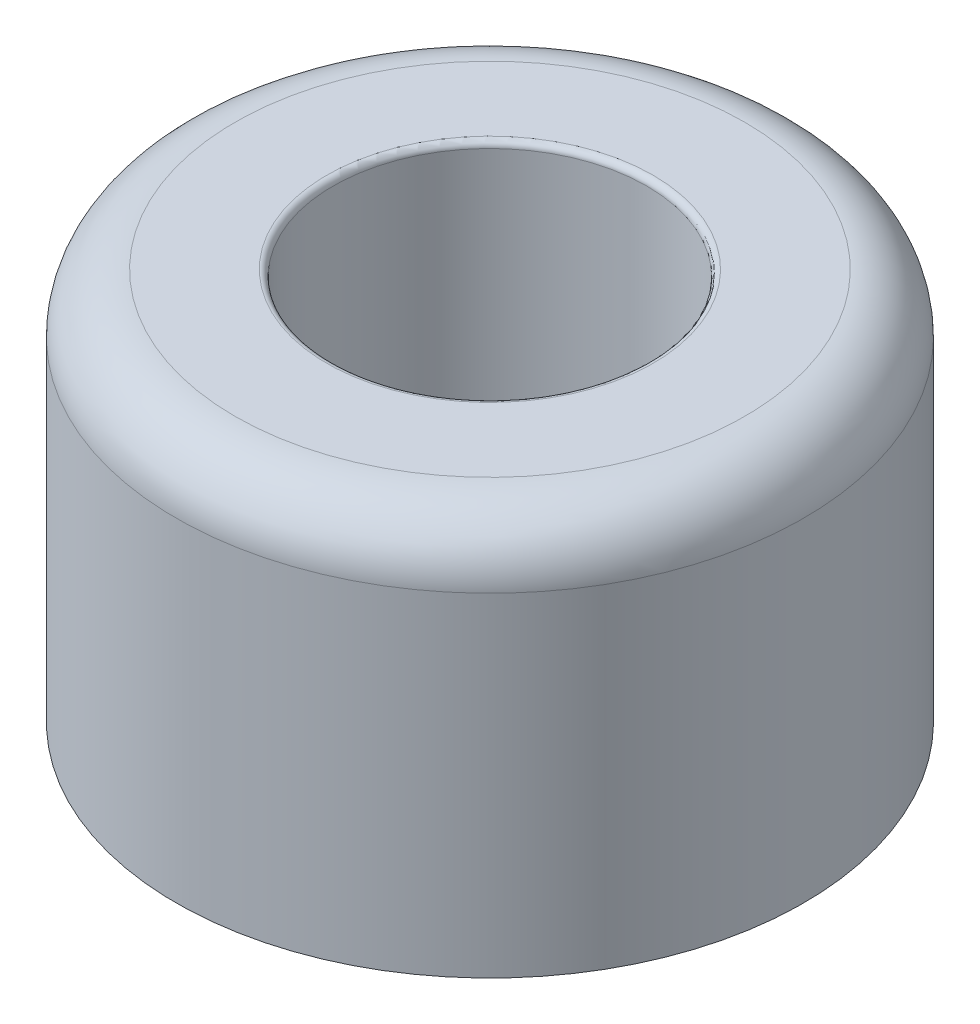
ISO-10303-21;
HEADER;
FILE_DESCRIPTION(('STEP AP214'),'2;1');
FILE_NAME('part.step','',(''),(''),'','','');
FILE_SCHEMA(('AUTOMOTIVE_DESIGN { 1 0 10303 214 1 1 1 1 }'));
ENDSEC;
DATA;
#1=APPLICATION_CONTEXT('core data for automotive mechanical design processes');
#2=APPLICATION_PROTOCOL_DEFINITION('international standard','automotive_design',2000,#1);
#3=PRODUCT_CONTEXT('',#1,'mechanical');
#4=PRODUCT('Part','Part','',(#3));
#5=PRODUCT_RELATED_PRODUCT_CATEGORY('part','',(#4));
#6=PRODUCT_DEFINITION_FORMATION('','',#4);
#7=PRODUCT_DEFINITION_CONTEXT('part definition',#1,'design');
#8=PRODUCT_DEFINITION('design','',#6,#7);
#9=PRODUCT_DEFINITION_SHAPE('','',#8);
#10=(LENGTH_UNIT() NAMED_UNIT(*) SI_UNIT(.MILLI.,.METRE.));
#11=(NAMED_UNIT(*) PLANE_ANGLE_UNIT() SI_UNIT($,.RADIAN.));
#12=(NAMED_UNIT(*) SI_UNIT($,.STERADIAN.) SOLID_ANGLE_UNIT());
#13=UNCERTAINTY_MEASURE_WITH_UNIT(LENGTH_MEASURE(1.E-05),#10,'distance_accuracy_value','');
#14=(GEOMETRIC_REPRESENTATION_CONTEXT(3) GLOBAL_UNCERTAINTY_ASSIGNED_CONTEXT((#13)) GLOBAL_UNIT_ASSIGNED_CONTEXT((#10,
#11,#12)) REPRESENTATION_CONTEXT('',''));
#15=CARTESIAN_POINT('',(0.,0.,0.));
#16=DIRECTION('',(0.,0.,1.));
#17=DIRECTION('',(1.,0.,0.));
#18=AXIS2_PLACEMENT_3D('',#15,#16,#17);
#19=CARTESIAN_POINT('',(-1.984375,0.,0.));
#20=DIRECTION('',(0.,1.,0.));
#21=DIRECTION('',(0.,0.,1.));
#22=AXIS2_PLACEMENT_3D('',#19,#20,#21);
#23=PLANE('',#22);
#24=CARTESIAN_POINT('',(0.,0.,0.));
#25=DIRECTION('',(0.,-1.,0.));
#26=DIRECTION('',(0.,0.,-1.));
#27=AXIS2_PLACEMENT_3D('',#24,#25,#26);
#28=CIRCLE('',#27,1.984375);
#29=CARTESIAN_POINT('',(0.,0.,-1.984375));
#30=VERTEX_POINT('',#29);
#31=EDGE_CURVE('E42',#30,#30,#28,.T.);
#32=ORIENTED_EDGE('',*,*,#31,.F.);
#33=EDGE_LOOP('',(#32));
#34=FACE_BOUND('',#33,.T.);
#35=CARTESIAN_POINT('',(0.,0.,0.));
#36=DIRECTION('',(0.,-1.,0.));
#37=DIRECTION('',(0.,0.,-1.));
#38=AXIS2_PLACEMENT_3D('',#35,#36,#37);
#39=CIRCLE('',#38,6.35);
#40=CARTESIAN_POINT('',(0.,0.,-6.35));
#41=VERTEX_POINT('',#40);
#42=EDGE_CURVE('E60',#41,#41,#39,.T.);
#43=ORIENTED_EDGE('',*,*,#42,.T.);
#44=EDGE_LOOP('',(#43));
#45=FACE_BOUND('',#44,.T.);
#46=ADVANCED_FACE('F31',(#34,#45),#23,.F.);
#47=CARTESIAN_POINT('',(0.,0.,0.));
#48=DIRECTION('',(0.,-1.,0.));
#49=DIRECTION('',(0.,0.,-1.));
#50=AXIS2_PLACEMENT_3D('',#47,#48,#49);
#51=CYLINDRICAL_SURFACE('',#50,1.984375);
#52=CARTESIAN_POINT('',(0.,3.175,0.));
#53=DIRECTION('',(0.,-1.,0.));
#54=DIRECTION('',(0.,0.,-1.));
#55=AXIS2_PLACEMENT_3D('',#52,#53,#54);
#56=CIRCLE('',#55,1.984375);
#57=CARTESIAN_POINT('',(0.,3.175,-1.984375));
#58=VERTEX_POINT('',#57);
#59=EDGE_CURVE('E46',#58,#58,#56,.T.);
#60=ORIENTED_EDGE('',*,*,#59,.F.);
#61=EDGE_LOOP('',(#60));
#62=FACE_BOUND('',#61,.T.);
#63=ORIENTED_EDGE('',*,*,#31,.T.);
#64=EDGE_LOOP('',(#63));
#65=FACE_BOUND('',#64,.T.);
#66=ADVANCED_FACE('F87',(#62,#65),#51,.F.);
#67=CARTESIAN_POINT('',(-3.175,3.175,0.));
#68=DIRECTION('',(0.,-1.,0.));
#69=DIRECTION('',(0.,0.,-1.));
#70=AXIS2_PLACEMENT_3D('',#67,#68,#69);
#71=PLANE('',#70);
#72=CARTESIAN_POINT('',(0.,3.17499999999999,0.));
#73=DIRECTION('',(0.,-1.,0.));
#74=DIRECTION('',(0.,0.,-1.));
#75=AXIS2_PLACEMENT_3D('',#72,#73,#74);
#76=CIRCLE('',#75,3.175);
#77=CARTESIAN_POINT('',(0.,3.17499999999999,-3.175));
#78=VERTEX_POINT('',#77);
#79=EDGE_CURVE('E51',#78,#78,#76,.T.);
#80=ORIENTED_EDGE('',*,*,#79,.F.);
#81=EDGE_LOOP('',(#80));
#82=FACE_BOUND('',#81,.T.);
#83=ORIENTED_EDGE('',*,*,#59,.T.);
#84=EDGE_LOOP('',(#83));
#85=FACE_BOUND('',#84,.T.);
#86=ADVANCED_FACE('F84',(#82,#85),#71,.F.);
#87=CARTESIAN_POINT('',(0.,0.,0.));
#88=DIRECTION('',(0.,-1.,0.));
#89=DIRECTION('',(0.,0.,-1.));
#90=AXIS2_PLACEMENT_3D('',#87,#88,#89);
#91=CYLINDRICAL_SURFACE('',#90,3.175);
#92=CARTESIAN_POINT('',(0.,7.8105,0.));
#93=DIRECTION('',(0.,-1.,0.));
#94=DIRECTION('',(0.,0.,-1.));
#95=AXIS2_PLACEMENT_3D('',#92,#93,#94);
#96=CIRCLE('',#95,3.175);
#97=CARTESIAN_POINT('',(0.,7.8105,-3.175));
#98=VERTEX_POINT('',#97);
#99=EDGE_CURVE('E10',#98,#98,#96,.F.);
#100=ORIENTED_EDGE('',*,*,#99,.T.);
#101=EDGE_LOOP('',(#100));
#102=FACE_BOUND('',#101,.T.);
#103=ORIENTED_EDGE('',*,*,#79,.T.);
#104=EDGE_LOOP('',(#103));
#105=FACE_BOUND('',#104,.T.);
#106=ADVANCED_FACE('F79',(#102,#105),#91,.F.);
#107=CARTESIAN_POINT('',(-5.159375,7.9375,0.));
#108=DIRECTION('',(0.,-1.,0.));
#109=DIRECTION('',(0.,0.,-1.));
#110=AXIS2_PLACEMENT_3D('',#107,#108,#109);
#111=PLANE('',#110);
#112=CARTESIAN_POINT('',(0.,7.9375,0.));
#113=DIRECTION('',(0.,-1.,0.));
#114=DIRECTION('',(0.,0.,-1.));
#115=AXIS2_PLACEMENT_3D('',#112,#113,#114);
#116=CIRCLE('',#115,3.302);
#117=CARTESIAN_POINT('',(0.,7.9375,-3.302));
#118=VERTEX_POINT('',#117);
#119=EDGE_CURVE('E38',#118,#118,#116,.T.);
#120=ORIENTED_EDGE('',*,*,#119,.T.);
#121=EDGE_LOOP('',(#120));
#122=FACE_BOUND('',#121,.T.);
#123=CARTESIAN_POINT('',(0.,7.9375,0.));
#124=DIRECTION('',(0.,-1.,0.));
#125=DIRECTION('',(0.,0.,-1.));
#126=AXIS2_PLACEMENT_3D('',#123,#124,#125);
#127=CIRCLE('',#126,5.159375);
#128=CARTESIAN_POINT('',(0.,7.9375,-5.159375));
#129=VERTEX_POINT('',#128);
#130=EDGE_CURVE('E54',#129,#129,#127,.T.);
#131=ORIENTED_EDGE('',*,*,#130,.F.);
#132=EDGE_LOOP('',(#131));
#133=FACE_BOUND('',#132,.T.);
#134=ADVANCED_FACE('F74',(#122,#133),#111,.F.);
#135=CARTESIAN_POINT('',(0.,6.746875,0.));
#136=DIRECTION('',(0.,-1.,0.));
#137=DIRECTION('',(0.,0.,-1.));
#138=AXIS2_PLACEMENT_3D('',#135,#136,#137);
#139=TOROIDAL_SURFACE('',#138,5.159375,1.190625);
#140=CARTESIAN_POINT('',(0.,6.746875,0.));
#141=DIRECTION('',(0.,-1.,0.));
#142=DIRECTION('',(0.,0.,-1.));
#143=AXIS2_PLACEMENT_3D('',#140,#141,#142);
#144=CIRCLE('',#143,6.35);
#145=CARTESIAN_POINT('',(0.,6.746875,-6.35));
#146=VERTEX_POINT('',#145);
#147=EDGE_CURVE('E57',#146,#146,#144,.T.);
#148=ORIENTED_EDGE('',*,*,#147,.F.);
#149=EDGE_LOOP('',(#148));
#150=FACE_BOUND('',#149,.T.);
#151=ORIENTED_EDGE('',*,*,#130,.T.);
#152=EDGE_LOOP('',(#151));
#153=FACE_BOUND('',#152,.T.);
#154=ADVANCED_FACE('F68',(#150,#153),#139,.T.);
#155=CARTESIAN_POINT('',(0.,0.,0.));
#156=DIRECTION('',(0.,-1.,0.));
#157=DIRECTION('',(0.,0.,-1.));
#158=AXIS2_PLACEMENT_3D('',#155,#156,#157);
#159=CYLINDRICAL_SURFACE('',#158,6.35);
#160=ORIENTED_EDGE('',*,*,#42,.F.);
#161=EDGE_LOOP('',(#160));
#162=FACE_BOUND('',#161,.T.);
#163=ORIENTED_EDGE('',*,*,#147,.T.);
#164=EDGE_LOOP('',(#163));
#165=FACE_BOUND('',#164,.T.);
#166=ADVANCED_FACE('F65',(#162,#165),#159,.T.);
#167=CARTESIAN_POINT('',(0.,7.8105,0.));
#168=DIRECTION('',(0.,-1.,0.));
#169=DIRECTION('',(0.,0.,-1.));
#170=AXIS2_PLACEMENT_3D('',#167,#168,#169);
#171=TOROIDAL_SURFACE('',#170,3.302,0.127);
#172=ORIENTED_EDGE('',*,*,#99,.F.);
#173=EDGE_LOOP('',(#172));
#174=FACE_BOUND('',#173,.T.);
#175=ORIENTED_EDGE('',*,*,#119,.F.);
#176=EDGE_LOOP('',(#175));
#177=FACE_BOUND('',#176,.T.);
#178=ADVANCED_FACE('F33',(#174,#177),#171,.T.);
#179=CLOSED_SHELL('',(#46,#66,#86,#106,#134,#154,#166,#178));
#180=MANIFOLD_SOLID_BREP('B2',#179);
#181=ADVANCED_BREP_SHAPE_REPRESENTATION('',(#18,#180),#14);
#182=SHAPE_DEFINITION_REPRESENTATION(#9,#181);
ENDSEC;
END-ISO-10303-21;
